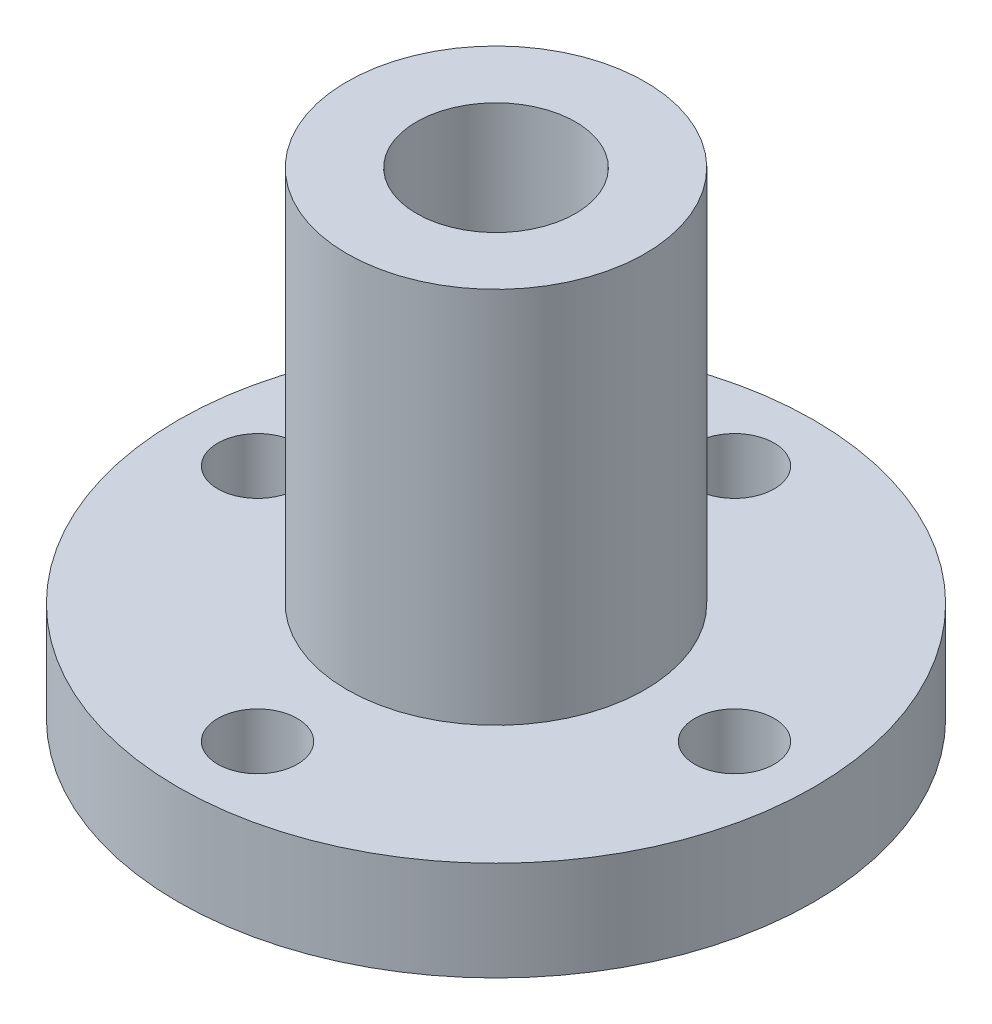
ISO-10303-21;
HEADER;
FILE_DESCRIPTION(('STEP AP214'),'2;1');
FILE_NAME('part.step','',(''),(''),'','','');
FILE_SCHEMA(('AUTOMOTIVE_DESIGN { 1 0 10303 214 1 1 1 1 }'));
ENDSEC;
DATA;
#1=APPLICATION_CONTEXT('core data for automotive mechanical design processes');
#2=APPLICATION_PROTOCOL_DEFINITION('international standard','automotive_design',2000,#1);
#3=PRODUCT_CONTEXT('',#1,'mechanical');
#4=PRODUCT('Part','Part','',(#3));
#5=PRODUCT_RELATED_PRODUCT_CATEGORY('part','',(#4));
#6=PRODUCT_DEFINITION_FORMATION('','',#4);
#7=PRODUCT_DEFINITION_CONTEXT('part definition',#1,'design');
#8=PRODUCT_DEFINITION('design','',#6,#7);
#9=PRODUCT_DEFINITION_SHAPE('','',#8);
#10=(LENGTH_UNIT() NAMED_UNIT(*) SI_UNIT(.MILLI.,.METRE.));
#11=(NAMED_UNIT(*) PLANE_ANGLE_UNIT() SI_UNIT($,.RADIAN.));
#12=(NAMED_UNIT(*) SI_UNIT($,.STERADIAN.) SOLID_ANGLE_UNIT());
#13=UNCERTAINTY_MEASURE_WITH_UNIT(LENGTH_MEASURE(1.E-05),#10,'distance_accuracy_value','');
#14=(GEOMETRIC_REPRESENTATION_CONTEXT(3) GLOBAL_UNCERTAINTY_ASSIGNED_CONTEXT((#13)) GLOBAL_UNIT_ASSIGNED_CONTEXT((#10,
#11,#12)) REPRESENTATION_CONTEXT('',''));
#15=CARTESIAN_POINT('',(0.,0.,0.));
#16=DIRECTION('',(0.,0.,1.));
#17=DIRECTION('',(1.,0.,0.));
#18=AXIS2_PLACEMENT_3D('',#15,#16,#17);
#19=CARTESIAN_POINT('',(0.,5.,0.));
#20=DIRECTION('',(0.,-1.,0.));
#21=DIRECTION('',(0.,0.,-1.));
#22=AXIS2_PLACEMENT_3D('',#19,#20,#21);
#23=CYLINDRICAL_SURFACE('',#22,16.);
#24=CARTESIAN_POINT('',(0.,5.,0.));
#25=DIRECTION('',(0.,1.,0.));
#26=DIRECTION('',(0.,0.,1.));
#27=AXIS2_PLACEMENT_3D('',#24,#25,#26);
#28=CIRCLE('',#27,16.);
#29=CARTESIAN_POINT('',(0.,5.,16.));
#30=VERTEX_POINT('',#29);
#31=EDGE_CURVE('E46',#30,#30,#28,.T.);
#32=ORIENTED_EDGE('',*,*,#31,.F.);
#33=EDGE_LOOP('',(#32));
#34=FACE_BOUND('',#33,.T.);
#35=CARTESIAN_POINT('',(0.,0.,0.));
#36=DIRECTION('',(0.,1.,0.));
#37=DIRECTION('',(0.,0.,1.));
#38=AXIS2_PLACEMENT_3D('',#35,#36,#37);
#39=CIRCLE('',#38,16.);
#40=CARTESIAN_POINT('',(0.,0.,16.));
#41=VERTEX_POINT('',#40);
#42=EDGE_CURVE('E54',#41,#41,#39,.T.);
#43=ORIENTED_EDGE('',*,*,#42,.T.);
#44=EDGE_LOOP('',(#43));
#45=FACE_BOUND('',#44,.T.);
#46=ADVANCED_FACE('F38',(#34,#45),#23,.T.);
#47=CARTESIAN_POINT('',(0.,5.,0.));
#48=DIRECTION('',(0.,1.,0.));
#49=DIRECTION('',(0.,0.,1.));
#50=AXIS2_PLACEMENT_3D('',#47,#48,#49);
#51=PLANE('',#50);
#52=CARTESIAN_POINT('',(0.,5.,-12.));
#53=DIRECTION('',(0.,1.,0.));
#54=DIRECTION('',(0.,0.,1.));
#55=AXIS2_PLACEMENT_3D('',#52,#53,#54);
#56=CIRCLE('',#55,2.);
#57=CARTESIAN_POINT('',(0.,5.,-10.));
#58=VERTEX_POINT('',#57);
#59=EDGE_CURVE('E67',#58,#58,#56,.T.);
#60=ORIENTED_EDGE('',*,*,#59,.F.);
#61=EDGE_LOOP('',(#60));
#62=FACE_BOUND('',#61,.T.);
#63=CARTESIAN_POINT('',(0.,5.,12.));
#64=DIRECTION('',(0.,1.,0.));
#65=DIRECTION('',(0.,0.,1.));
#66=AXIS2_PLACEMENT_3D('',#63,#64,#65);
#67=CIRCLE('',#66,2.);
#68=CARTESIAN_POINT('',(0.,5.,14.));
#69=VERTEX_POINT('',#68);
#70=EDGE_CURVE('E95',#69,#69,#67,.T.);
#71=ORIENTED_EDGE('',*,*,#70,.F.);
#72=EDGE_LOOP('',(#71));
#73=FACE_BOUND('',#72,.T.);
#74=CARTESIAN_POINT('',(12.,5.,0.));
#75=DIRECTION('',(0.,1.,0.));
#76=DIRECTION('',(0.,0.,1.));
#77=AXIS2_PLACEMENT_3D('',#74,#75,#76);
#78=CIRCLE('',#77,2.);
#79=CARTESIAN_POINT('',(12.,5.,2.));
#80=VERTEX_POINT('',#79);
#81=EDGE_CURVE('E91',#80,#80,#78,.T.);
#82=ORIENTED_EDGE('',*,*,#81,.F.);
#83=EDGE_LOOP('',(#82));
#84=FACE_BOUND('',#83,.T.);
#85=CARTESIAN_POINT('',(-12.,5.,0.));
#86=DIRECTION('',(0.,1.,0.));
#87=DIRECTION('',(0.,0.,1.));
#88=AXIS2_PLACEMENT_3D('',#85,#86,#87);
#89=CIRCLE('',#88,2.);
#90=CARTESIAN_POINT('',(-12.,5.,2.));
#91=VERTEX_POINT('',#90);
#92=EDGE_CURVE('E88',#91,#91,#89,.T.);
#93=ORIENTED_EDGE('',*,*,#92,.F.);
#94=EDGE_LOOP('',(#93));
#95=FACE_BOUND('',#94,.T.);
#96=CARTESIAN_POINT('',(0.,5.,0.));
#97=DIRECTION('',(0.,1.,0.));
#98=DIRECTION('',(0.,0.,1.));
#99=AXIS2_PLACEMENT_3D('',#96,#97,#98);
#100=CIRCLE('',#99,7.5);
#101=CARTESIAN_POINT('',(0.,5.,7.5));
#102=VERTEX_POINT('',#101);
#103=EDGE_CURVE('E10',#102,#102,#100,.T.);
#104=ORIENTED_EDGE('',*,*,#103,.F.);
#105=EDGE_LOOP('',(#104));
#106=FACE_BOUND('',#105,.T.);
#107=ORIENTED_EDGE('',*,*,#31,.T.);
#108=EDGE_LOOP('',(#107));
#109=FACE_BOUND('',#108,.T.);
#110=ADVANCED_FACE('F106',(#62,#73,#84,#95,#106,#109),#51,.T.);
#111=CARTESIAN_POINT('',(0.,0.,0.));
#112=DIRECTION('',(0.,1.,0.));
#113=DIRECTION('',(0.,0.,1.));
#114=AXIS2_PLACEMENT_3D('',#111,#112,#113);
#115=PLANE('',#114);
#116=CARTESIAN_POINT('',(0.,0.,-12.));
#117=DIRECTION('',(0.,1.,0.));
#118=DIRECTION('',(0.,0.,1.));
#119=AXIS2_PLACEMENT_3D('',#116,#117,#118);
#120=CIRCLE('',#119,2.);
#121=CARTESIAN_POINT('',(0.,0.,-10.));
#122=VERTEX_POINT('',#121);
#123=EDGE_CURVE('E41',#122,#122,#120,.T.);
#124=ORIENTED_EDGE('',*,*,#123,.T.);
#125=EDGE_LOOP('',(#124));
#126=FACE_BOUND('',#125,.T.);
#127=CARTESIAN_POINT('',(0.,0.,12.));
#128=DIRECTION('',(0.,1.,0.));
#129=DIRECTION('',(0.,0.,1.));
#130=AXIS2_PLACEMENT_3D('',#127,#128,#129);
#131=CIRCLE('',#130,2.);
#132=CARTESIAN_POINT('',(0.,0.,14.));
#133=VERTEX_POINT('',#132);
#134=EDGE_CURVE('E70',#133,#133,#131,.T.);
#135=ORIENTED_EDGE('',*,*,#134,.T.);
#136=EDGE_LOOP('',(#135));
#137=FACE_BOUND('',#136,.T.);
#138=CARTESIAN_POINT('',(12.,0.,0.));
#139=DIRECTION('',(0.,1.,0.));
#140=DIRECTION('',(0.,0.,1.));
#141=AXIS2_PLACEMENT_3D('',#138,#139,#140);
#142=CIRCLE('',#141,2.);
#143=CARTESIAN_POINT('',(12.,0.,2.));
#144=VERTEX_POINT('',#143);
#145=EDGE_CURVE('E66',#144,#144,#142,.T.);
#146=ORIENTED_EDGE('',*,*,#145,.T.);
#147=EDGE_LOOP('',(#146));
#148=FACE_BOUND('',#147,.T.);
#149=CARTESIAN_POINT('',(-12.,0.,0.));
#150=DIRECTION('',(0.,1.,0.));
#151=DIRECTION('',(0.,0.,1.));
#152=AXIS2_PLACEMENT_3D('',#149,#150,#151);
#153=CIRCLE('',#152,2.);
#154=CARTESIAN_POINT('',(-12.,0.,2.));
#155=VERTEX_POINT('',#154);
#156=EDGE_CURVE('E63',#155,#155,#153,.T.);
#157=ORIENTED_EDGE('',*,*,#156,.T.);
#158=EDGE_LOOP('',(#157));
#159=FACE_BOUND('',#158,.T.);
#160=CARTESIAN_POINT('',(0.,0.,0.));
#161=DIRECTION('',(0.,1.,0.));
#162=DIRECTION('',(0.,0.,1.));
#163=AXIS2_PLACEMENT_3D('',#160,#161,#162);
#164=CIRCLE('',#163,4.);
#165=CARTESIAN_POINT('',(0.,0.,4.));
#166=VERTEX_POINT('',#165);
#167=EDGE_CURVE('E81',#166,#166,#164,.T.);
#168=ORIENTED_EDGE('',*,*,#167,.T.);
#169=EDGE_LOOP('',(#168));
#170=FACE_BOUND('',#169,.T.);
#171=ORIENTED_EDGE('',*,*,#42,.F.);
#172=EDGE_LOOP('',(#171));
#173=FACE_BOUND('',#172,.T.);
#174=ADVANCED_FACE('F109',(#126,#137,#148,#159,#170,#173),#115,.F.);
#175=CARTESIAN_POINT('',(0.,24.,0.));
#176=DIRECTION('',(0.,-1.,0.));
#177=DIRECTION('',(0.,0.,-1.));
#178=AXIS2_PLACEMENT_3D('',#175,#176,#177);
#179=CYLINDRICAL_SURFACE('',#178,7.5);
#180=CARTESIAN_POINT('',(0.,24.,0.));
#181=DIRECTION('',(0.,1.,0.));
#182=DIRECTION('',(0.,0.,1.));
#183=AXIS2_PLACEMENT_3D('',#180,#181,#182);
#184=CIRCLE('',#183,7.5);
#185=CARTESIAN_POINT('',(0.,24.,7.5));
#186=VERTEX_POINT('',#185);
#187=EDGE_CURVE('E57',#186,#186,#184,.T.);
#188=ORIENTED_EDGE('',*,*,#187,.F.);
#189=EDGE_LOOP('',(#188));
#190=FACE_BOUND('',#189,.T.);
#191=ORIENTED_EDGE('',*,*,#103,.T.);
#192=EDGE_LOOP('',(#191));
#193=FACE_BOUND('',#192,.T.);
#194=ADVANCED_FACE('F125',(#190,#193),#179,.T.);
#195=CARTESIAN_POINT('',(0.,24.,0.));
#196=DIRECTION('',(0.,1.,0.));
#197=DIRECTION('',(0.,0.,1.));
#198=AXIS2_PLACEMENT_3D('',#195,#196,#197);
#199=PLANE('',#198);
#200=CARTESIAN_POINT('',(0.,24.,0.));
#201=DIRECTION('',(0.,1.,0.));
#202=DIRECTION('',(0.,0.,1.));
#203=AXIS2_PLACEMENT_3D('',#200,#201,#202);
#204=CIRCLE('',#203,4.);
#205=CARTESIAN_POINT('',(0.,24.,4.));
#206=VERTEX_POINT('',#205);
#207=EDGE_CURVE('E76',#206,#206,#204,.T.);
#208=ORIENTED_EDGE('',*,*,#207,.F.);
#209=EDGE_LOOP('',(#208));
#210=FACE_BOUND('',#209,.T.);
#211=ORIENTED_EDGE('',*,*,#187,.T.);
#212=EDGE_LOOP('',(#211));
#213=FACE_BOUND('',#212,.T.);
#214=ADVANCED_FACE('F129',(#210,#213),#199,.T.);
#215=CARTESIAN_POINT('',(0.,-26.,0.));
#216=DIRECTION('',(0.,1.,0.));
#217=DIRECTION('',(0.,0.,1.));
#218=AXIS2_PLACEMENT_3D('',#215,#216,#217);
#219=CYLINDRICAL_SURFACE('',#218,4.);
#220=ORIENTED_EDGE('',*,*,#207,.T.);
#221=EDGE_LOOP('',(#220));
#222=FACE_BOUND('',#221,.T.);
#223=ORIENTED_EDGE('',*,*,#167,.F.);
#224=EDGE_LOOP('',(#223));
#225=FACE_BOUND('',#224,.T.);
#226=ADVANCED_FACE('F135',(#222,#225),#219,.F.);
#227=CARTESIAN_POINT('',(-12.,-45.,0.));
#228=DIRECTION('',(0.,1.,0.));
#229=DIRECTION('',(0.,0.,1.));
#230=AXIS2_PLACEMENT_3D('',#227,#228,#229);
#231=CYLINDRICAL_SURFACE('',#230,2.);
#232=ORIENTED_EDGE('',*,*,#92,.T.);
#233=EDGE_LOOP('',(#232));
#234=FACE_BOUND('',#233,.T.);
#235=ORIENTED_EDGE('',*,*,#156,.F.);
#236=EDGE_LOOP('',(#235));
#237=FACE_BOUND('',#236,.T.);
#238=ADVANCED_FACE('F139',(#234,#237),#231,.F.);
#239=CARTESIAN_POINT('',(12.,-45.,0.));
#240=DIRECTION('',(0.,1.,0.));
#241=DIRECTION('',(0.,0.,1.));
#242=AXIS2_PLACEMENT_3D('',#239,#240,#241);
#243=CYLINDRICAL_SURFACE('',#242,2.);
#244=ORIENTED_EDGE('',*,*,#81,.T.);
#245=EDGE_LOOP('',(#244));
#246=FACE_BOUND('',#245,.T.);
#247=ORIENTED_EDGE('',*,*,#145,.F.);
#248=EDGE_LOOP('',(#247));
#249=FACE_BOUND('',#248,.T.);
#250=ADVANCED_FACE('F142',(#246,#249),#243,.F.);
#251=CARTESIAN_POINT('',(0.,-45.,12.));
#252=DIRECTION('',(0.,1.,0.));
#253=DIRECTION('',(0.,0.,1.));
#254=AXIS2_PLACEMENT_3D('',#251,#252,#253);
#255=CYLINDRICAL_SURFACE('',#254,2.);
#256=ORIENTED_EDGE('',*,*,#70,.T.);
#257=EDGE_LOOP('',(#256));
#258=FACE_BOUND('',#257,.T.);
#259=ORIENTED_EDGE('',*,*,#134,.F.);
#260=EDGE_LOOP('',(#259));
#261=FACE_BOUND('',#260,.T.);
#262=ADVANCED_FACE('F146',(#258,#261),#255,.F.);
#263=CARTESIAN_POINT('',(0.,-45.,-12.));
#264=DIRECTION('',(0.,1.,0.));
#265=DIRECTION('',(0.,0.,1.));
#266=AXIS2_PLACEMENT_3D('',#263,#264,#265);
#267=CYLINDRICAL_SURFACE('',#266,2.);
#268=ORIENTED_EDGE('',*,*,#59,.T.);
#269=EDGE_LOOP('',(#268));
#270=FACE_BOUND('',#269,.T.);
#271=ORIENTED_EDGE('',*,*,#123,.F.);
#272=EDGE_LOOP('',(#271));
#273=FACE_BOUND('',#272,.T.);
#274=ADVANCED_FACE('F103',(#270,#273),#267,.F.);
#275=CLOSED_SHELL('',(#46,#110,#174,#194,#214,#226,#238,#250,#262,#274));
#276=MANIFOLD_SOLID_BREP('B2',#275);
#277=ADVANCED_BREP_SHAPE_REPRESENTATION('',(#18,#276),#14);
#278=SHAPE_DEFINITION_REPRESENTATION(#9,#277);
ENDSEC;
END-ISO-10303-21;
